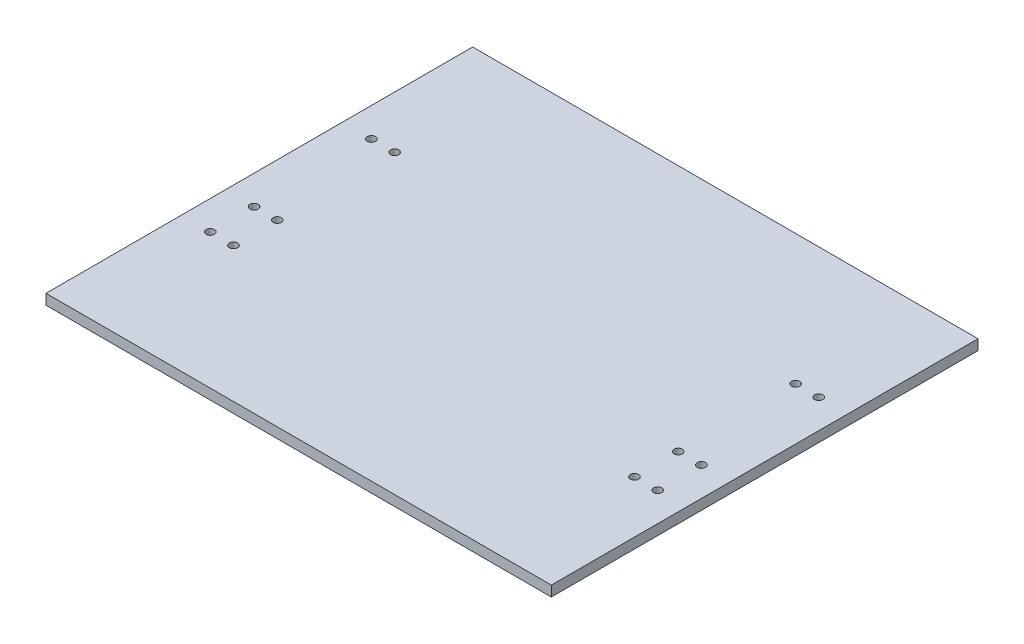
ISO-10303-21;
HEADER;
FILE_DESCRIPTION(('STEP AP214'),'2;1');
FILE_NAME('part.step','',(''),(''),'','','');
FILE_SCHEMA(('AUTOMOTIVE_DESIGN { 1 0 10303 214 1 1 1 1 }'));
ENDSEC;
DATA;
#1=APPLICATION_CONTEXT('core data for automotive mechanical design processes');
#2=APPLICATION_PROTOCOL_DEFINITION('international standard','automotive_design',2000,#1);
#3=PRODUCT_CONTEXT('',#1,'mechanical');
#4=PRODUCT('Part','Part','',(#3));
#5=PRODUCT_RELATED_PRODUCT_CATEGORY('part','',(#4));
#6=PRODUCT_DEFINITION_FORMATION('','',#4);
#7=PRODUCT_DEFINITION_CONTEXT('part definition',#1,'design');
#8=PRODUCT_DEFINITION('design','',#6,#7);
#9=PRODUCT_DEFINITION_SHAPE('','',#8);
#10=(LENGTH_UNIT() NAMED_UNIT(*) SI_UNIT(.MILLI.,.METRE.));
#11=(NAMED_UNIT(*) PLANE_ANGLE_UNIT() SI_UNIT($,.RADIAN.));
#12=(NAMED_UNIT(*) SI_UNIT($,.STERADIAN.) SOLID_ANGLE_UNIT());
#13=UNCERTAINTY_MEASURE_WITH_UNIT(LENGTH_MEASURE(1.E-05),#10,'distance_accuracy_value','');
#14=(GEOMETRIC_REPRESENTATION_CONTEXT(3) GLOBAL_UNCERTAINTY_ASSIGNED_CONTEXT((#13)) GLOBAL_UNIT_ASSIGNED_CONTEXT((#10,
#11,#12)) REPRESENTATION_CONTEXT('',''));
#15=CARTESIAN_POINT('',(0.,0.,0.));
#16=DIRECTION('',(0.,0.,1.));
#17=DIRECTION('',(1.,0.,0.));
#18=AXIS2_PLACEMENT_3D('',#15,#16,#17);
#19=CARTESIAN_POINT('',(-61.,0.,-51.5));
#20=DIRECTION('',(0.,0.,1.));
#21=DIRECTION('',(1.,0.,0.));
#22=AXIS2_PLACEMENT_3D('',#19,#20,#21);
#23=PLANE('',#22);
#24=DIRECTION('',(0.,-1.,0.));
#25=VECTOR('',#24,1.);
#26=CARTESIAN_POINT('',(-61.,1.25,-51.5));
#27=LINE('',#26,#25);
#28=CARTESIAN_POINT('',(-61.,2.5,-51.5));
#29=VERTEX_POINT('',#28);
#30=CARTESIAN_POINT('',(-61.,0.,-51.5));
#31=VERTEX_POINT('',#30);
#32=EDGE_CURVE('E62',#29,#31,#27,.T.);
#33=ORIENTED_EDGE('',*,*,#32,.F.);
#34=DIRECTION('',(1.,0.,0.));
#35=VECTOR('',#34,1.);
#36=CARTESIAN_POINT('',(0.,2.5,-51.5));
#37=LINE('',#36,#35);
#38=CARTESIAN_POINT('',(61.,2.5,-51.5));
#39=VERTEX_POINT('',#38);
#40=EDGE_CURVE('E65',#29,#39,#37,.T.);
#41=ORIENTED_EDGE('',*,*,#40,.T.);
#42=DIRECTION('',(0.,1.,0.));
#43=VECTOR('',#42,1.);
#44=CARTESIAN_POINT('',(61.,1.25,-51.5));
#45=LINE('',#44,#43);
#46=CARTESIAN_POINT('',(61.,0.,-51.5));
#47=VERTEX_POINT('',#46);
#48=EDGE_CURVE('E85',#47,#39,#45,.T.);
#49=ORIENTED_EDGE('',*,*,#48,.F.);
#50=DIRECTION('',(1.,0.,0.));
#51=VECTOR('',#50,1.);
#52=CARTESIAN_POINT('',(0.,0.,-51.5));
#53=LINE('',#52,#51);
#54=EDGE_CURVE('E66',#31,#47,#53,.T.);
#55=ORIENTED_EDGE('',*,*,#54,.F.);
#56=EDGE_LOOP('',(#33,#41,#49,#55));
#57=FACE_BOUND('',#56,.T.);
#58=ADVANCED_FACE('F17',(#57),#23,.F.);
#59=CARTESIAN_POINT('',(61.,0.,51.5));
#60=DIRECTION('',(1.,0.,0.));
#61=DIRECTION('',(0.,0.,-1.));
#62=AXIS2_PLACEMENT_3D('',#59,#60,#61);
#63=PLANE('',#62);
#64=ORIENTED_EDGE('',*,*,#48,.T.);
#65=DIRECTION('',(0.,0.,1.));
#66=VECTOR('',#65,1.);
#67=CARTESIAN_POINT('',(61.,2.5,0.));
#68=LINE('',#67,#66);
#69=CARTESIAN_POINT('',(61.,2.5,51.5));
#70=VERTEX_POINT('',#69);
#71=EDGE_CURVE('E76',#39,#70,#68,.T.);
#72=ORIENTED_EDGE('',*,*,#71,.T.);
#73=DIRECTION('',(0.,-1.,0.));
#74=VECTOR('',#73,1.);
#75=CARTESIAN_POINT('',(61.,1.25,51.5));
#76=LINE('',#75,#74);
#77=CARTESIAN_POINT('',(61.,0.,51.5));
#78=VERTEX_POINT('',#77);
#79=EDGE_CURVE('E67',#70,#78,#76,.T.);
#80=ORIENTED_EDGE('',*,*,#79,.T.);
#81=DIRECTION('',(0.,0.,1.));
#82=VECTOR('',#81,1.);
#83=CARTESIAN_POINT('',(61.,0.,0.));
#84=LINE('',#83,#82);
#85=EDGE_CURVE('E161',#47,#78,#84,.T.);
#86=ORIENTED_EDGE('',*,*,#85,.F.);
#87=EDGE_LOOP('',(#64,#72,#80,#86));
#88=FACE_BOUND('',#87,.T.);
#89=ADVANCED_FACE('F166',(#88),#63,.T.);
#90=CARTESIAN_POINT('',(61.,0.,51.5));
#91=DIRECTION('',(0.,0.,-1.));
#92=DIRECTION('',(-1.,0.,0.));
#93=AXIS2_PLACEMENT_3D('',#90,#91,#92);
#94=PLANE('',#93);
#95=ORIENTED_EDGE('',*,*,#79,.F.);
#96=DIRECTION('',(-1.,0.,0.));
#97=VECTOR('',#96,1.);
#98=CARTESIAN_POINT('',(0.,2.5,51.5));
#99=LINE('',#98,#97);
#100=CARTESIAN_POINT('',(-61.,2.5,51.5));
#101=VERTEX_POINT('',#100);
#102=EDGE_CURVE('E154',#70,#101,#99,.T.);
#103=ORIENTED_EDGE('',*,*,#102,.T.);
#104=DIRECTION('',(0.,1.,0.));
#105=VECTOR('',#104,1.);
#106=CARTESIAN_POINT('',(-61.,1.25,51.5));
#107=LINE('',#106,#105);
#108=CARTESIAN_POINT('',(-61.,0.,51.5));
#109=VERTEX_POINT('',#108);
#110=EDGE_CURVE('E56',#109,#101,#107,.T.);
#111=ORIENTED_EDGE('',*,*,#110,.F.);
#112=DIRECTION('',(-1.,0.,0.));
#113=VECTOR('',#112,1.);
#114=CARTESIAN_POINT('',(0.,0.,51.5));
#115=LINE('',#114,#113);
#116=EDGE_CURVE('E36',#78,#109,#115,.T.);
#117=ORIENTED_EDGE('',*,*,#116,.F.);
#118=EDGE_LOOP('',(#95,#103,#111,#117));
#119=FACE_BOUND('',#118,.T.);
#120=ADVANCED_FACE('F167',(#119),#94,.F.);
#121=CARTESIAN_POINT('',(-61.,0.,-51.5));
#122=DIRECTION('',(-1.,0.,0.));
#123=DIRECTION('',(0.,0.,1.));
#124=AXIS2_PLACEMENT_3D('',#121,#122,#123);
#125=PLANE('',#124);
#126=ORIENTED_EDGE('',*,*,#110,.T.);
#127=DIRECTION('',(0.,0.,-1.));
#128=VECTOR('',#127,1.);
#129=CARTESIAN_POINT('',(-61.,2.5,0.));
#130=LINE('',#129,#128);
#131=EDGE_CURVE('E73',#101,#29,#130,.T.);
#132=ORIENTED_EDGE('',*,*,#131,.T.);
#133=ORIENTED_EDGE('',*,*,#32,.T.);
#134=DIRECTION('',(0.,0.,-1.));
#135=VECTOR('',#134,1.);
#136=CARTESIAN_POINT('',(-61.,0.,0.));
#137=LINE('',#136,#135);
#138=EDGE_CURVE('E122',#109,#31,#137,.T.);
#139=ORIENTED_EDGE('',*,*,#138,.F.);
#140=EDGE_LOOP('',(#126,#132,#133,#139));
#141=FACE_BOUND('',#140,.T.);
#142=ADVANCED_FACE('F78',(#141),#125,.T.);
#143=CARTESIAN_POINT('',(48.4,2.5,8.27));
#144=DIRECTION('',(0.,-1.,0.));
#145=DIRECTION('',(1.,0.,0.));
#146=AXIS2_PLACEMENT_3D('',#143,#144,#145);
#147=CYLINDRICAL_SURFACE('',#146,0.999999999999999);
#148=CARTESIAN_POINT('',(48.4,0.,8.27));
#149=DIRECTION('',(0.,-1.,0.));
#150=DIRECTION('',(1.,0.,0.));
#151=AXIS2_PLACEMENT_3D('',#148,#149,#150);
#152=CIRCLE('',#151,0.999999999999999);
#153=CARTESIAN_POINT('',(49.4,0.,8.27));
#154=VERTEX_POINT('',#153);
#155=EDGE_CURVE('E119',#154,#154,#152,.F.);
#156=ORIENTED_EDGE('',*,*,#155,.F.);
#157=EDGE_LOOP('',(#156));
#158=FACE_BOUND('',#157,.T.);
#159=CARTESIAN_POINT('',(48.4,2.5,8.27));
#160=DIRECTION('',(0.,-1.,0.));
#161=DIRECTION('',(1.,0.,0.));
#162=AXIS2_PLACEMENT_3D('',#159,#160,#161);
#163=CIRCLE('',#162,0.999999999999999);
#164=CARTESIAN_POINT('',(49.4,2.5,8.27));
#165=VERTEX_POINT('',#164);
#166=EDGE_CURVE('E21',#165,#165,#163,.F.);
#167=ORIENTED_EDGE('',*,*,#166,.T.);
#168=EDGE_LOOP('',(#167));
#169=FACE_BOUND('',#168,.T.);
#170=ADVANCED_FACE('F175',(#158,#169),#147,.F.);
#171=CARTESIAN_POINT('',(48.4,2.5,-20.06));
#172=DIRECTION('',(0.,-1.,0.));
#173=DIRECTION('',(1.,0.,0.));
#174=AXIS2_PLACEMENT_3D('',#171,#172,#173);
#175=CYLINDRICAL_SURFACE('',#174,1.);
#176=CARTESIAN_POINT('',(48.4,0.,-20.06));
#177=DIRECTION('',(0.,-1.,0.));
#178=DIRECTION('',(1.,0.,0.));
#179=AXIS2_PLACEMENT_3D('',#176,#177,#178);
#180=CIRCLE('',#179,1.);
#181=CARTESIAN_POINT('',(49.4,0.,-20.06));
#182=VERTEX_POINT('',#181);
#183=EDGE_CURVE('E116',#182,#182,#180,.F.);
#184=ORIENTED_EDGE('',*,*,#183,.F.);
#185=EDGE_LOOP('',(#184));
#186=FACE_BOUND('',#185,.T.);
#187=CARTESIAN_POINT('',(48.4,2.5,-20.06));
#188=DIRECTION('',(0.,-1.,0.));
#189=DIRECTION('',(1.,0.,0.));
#190=AXIS2_PLACEMENT_3D('',#187,#188,#189);
#191=CIRCLE('',#190,1.);
#192=CARTESIAN_POINT('',(49.4,2.5,-20.06));
#193=VERTEX_POINT('',#192);
#194=EDGE_CURVE('E149',#193,#193,#191,.F.);
#195=ORIENTED_EDGE('',*,*,#194,.T.);
#196=EDGE_LOOP('',(#195));
#197=FACE_BOUND('',#196,.T.);
#198=ADVANCED_FACE('F223',(#186,#197),#175,.F.);
#199=CARTESIAN_POINT('',(-48.4,2.5,8.27));
#200=DIRECTION('',(0.,-1.,0.));
#201=DIRECTION('',(1.,0.,0.));
#202=AXIS2_PLACEMENT_3D('',#199,#200,#201);
#203=CYLINDRICAL_SURFACE('',#202,0.999999999999999);
#204=CARTESIAN_POINT('',(-48.4,0.,8.27));
#205=DIRECTION('',(0.,-1.,0.));
#206=DIRECTION('',(1.,0.,0.));
#207=AXIS2_PLACEMENT_3D('',#204,#205,#206);
#208=CIRCLE('',#207,0.999999999999999);
#209=CARTESIAN_POINT('',(-47.4,0.,8.27));
#210=VERTEX_POINT('',#209);
#211=EDGE_CURVE('E113',#210,#210,#208,.F.);
#212=ORIENTED_EDGE('',*,*,#211,.F.);
#213=EDGE_LOOP('',(#212));
#214=FACE_BOUND('',#213,.T.);
#215=CARTESIAN_POINT('',(-48.4,2.5,8.27));
#216=DIRECTION('',(0.,-1.,0.));
#217=DIRECTION('',(1.,0.,0.));
#218=AXIS2_PLACEMENT_3D('',#215,#216,#217);
#219=CIRCLE('',#218,0.999999999999999);
#220=CARTESIAN_POINT('',(-47.4,2.5,8.27));
#221=VERTEX_POINT('',#220);
#222=EDGE_CURVE('E147',#221,#221,#219,.F.);
#223=ORIENTED_EDGE('',*,*,#222,.T.);
#224=EDGE_LOOP('',(#223));
#225=FACE_BOUND('',#224,.T.);
#226=ADVANCED_FACE('F219',(#214,#225),#203,.F.);
#227=CARTESIAN_POINT('',(-48.4,2.5,-20.06));
#228=DIRECTION('',(0.,-1.,0.));
#229=DIRECTION('',(1.,0.,0.));
#230=AXIS2_PLACEMENT_3D('',#227,#228,#229);
#231=CYLINDRICAL_SURFACE('',#230,1.);
#232=CARTESIAN_POINT('',(-48.4,0.,-20.06));
#233=DIRECTION('',(0.,-1.,0.));
#234=DIRECTION('',(1.,0.,0.));
#235=AXIS2_PLACEMENT_3D('',#232,#233,#234);
#236=CIRCLE('',#235,1.);
#237=CARTESIAN_POINT('',(-47.4,0.,-20.06));
#238=VERTEX_POINT('',#237);
#239=EDGE_CURVE('E110',#238,#238,#236,.F.);
#240=ORIENTED_EDGE('',*,*,#239,.F.);
#241=EDGE_LOOP('',(#240));
#242=FACE_BOUND('',#241,.T.);
#243=CARTESIAN_POINT('',(-48.4,2.5,-20.06));
#244=DIRECTION('',(0.,-1.,0.));
#245=DIRECTION('',(1.,0.,0.));
#246=AXIS2_PLACEMENT_3D('',#243,#244,#245);
#247=CIRCLE('',#246,1.);
#248=CARTESIAN_POINT('',(-47.4,2.5,-20.06));
#249=VERTEX_POINT('',#248);
#250=EDGE_CURVE('E144',#249,#249,#247,.F.);
#251=ORIENTED_EDGE('',*,*,#250,.T.);
#252=EDGE_LOOP('',(#251));
#253=FACE_BOUND('',#252,.T.);
#254=ADVANCED_FACE('F215',(#242,#253),#231,.F.);
#255=CARTESIAN_POINT('',(-48.4,2.5,18.84));
#256=DIRECTION('',(0.,-1.,0.));
#257=DIRECTION('',(1.,0.,0.));
#258=AXIS2_PLACEMENT_3D('',#255,#256,#257);
#259=CYLINDRICAL_SURFACE('',#258,0.999999999999997);
#260=CARTESIAN_POINT('',(-48.4,0.,18.84));
#261=DIRECTION('',(0.,-1.,0.));
#262=DIRECTION('',(1.,0.,0.));
#263=AXIS2_PLACEMENT_3D('',#260,#261,#262);
#264=CIRCLE('',#263,0.999999999999997);
#265=CARTESIAN_POINT('',(-47.4,0.,18.84));
#266=VERTEX_POINT('',#265);
#267=EDGE_CURVE('E107',#266,#266,#264,.F.);
#268=ORIENTED_EDGE('',*,*,#267,.F.);
#269=EDGE_LOOP('',(#268));
#270=FACE_BOUND('',#269,.T.);
#271=CARTESIAN_POINT('',(-48.4,2.5,18.84));
#272=DIRECTION('',(0.,-1.,0.));
#273=DIRECTION('',(1.,0.,0.));
#274=AXIS2_PLACEMENT_3D('',#271,#272,#273);
#275=CIRCLE('',#274,0.999999999999997);
#276=CARTESIAN_POINT('',(-47.4,2.5,18.84));
#277=VERTEX_POINT('',#276);
#278=EDGE_CURVE('E141',#277,#277,#275,.F.);
#279=ORIENTED_EDGE('',*,*,#278,.T.);
#280=EDGE_LOOP('',(#279));
#281=FACE_BOUND('',#280,.T.);
#282=ADVANCED_FACE('F211',(#270,#281),#259,.F.);
#283=CARTESIAN_POINT('',(54.,2.5,18.84));
#284=DIRECTION('',(0.,-1.,0.));
#285=DIRECTION('',(1.,0.,0.));
#286=AXIS2_PLACEMENT_3D('',#283,#284,#285);
#287=CYLINDRICAL_SURFACE('',#286,0.999999999999997);
#288=CARTESIAN_POINT('',(54.,0.,18.84));
#289=DIRECTION('',(0.,-1.,0.));
#290=DIRECTION('',(1.,0.,0.));
#291=AXIS2_PLACEMENT_3D('',#288,#289,#290);
#292=CIRCLE('',#291,0.999999999999997);
#293=CARTESIAN_POINT('',(55.,0.,18.84));
#294=VERTEX_POINT('',#293);
#295=EDGE_CURVE('E104',#294,#294,#292,.F.);
#296=ORIENTED_EDGE('',*,*,#295,.F.);
#297=EDGE_LOOP('',(#296));
#298=FACE_BOUND('',#297,.T.);
#299=CARTESIAN_POINT('',(54.,2.5,18.84));
#300=DIRECTION('',(0.,-1.,0.));
#301=DIRECTION('',(1.,0.,0.));
#302=AXIS2_PLACEMENT_3D('',#299,#300,#301);
#303=CIRCLE('',#302,0.999999999999997);
#304=CARTESIAN_POINT('',(55.,2.5,18.84));
#305=VERTEX_POINT('',#304);
#306=EDGE_CURVE('E138',#305,#305,#303,.F.);
#307=ORIENTED_EDGE('',*,*,#306,.T.);
#308=EDGE_LOOP('',(#307));
#309=FACE_BOUND('',#308,.T.);
#310=ADVANCED_FACE('F207',(#298,#309),#287,.F.);
#311=CARTESIAN_POINT('',(54.,2.5,8.27));
#312=DIRECTION('',(0.,-1.,0.));
#313=DIRECTION('',(1.,0.,0.));
#314=AXIS2_PLACEMENT_3D('',#311,#312,#313);
#315=CYLINDRICAL_SURFACE('',#314,0.999999999999999);
#316=CARTESIAN_POINT('',(54.,0.,8.27));
#317=DIRECTION('',(0.,-1.,0.));
#318=DIRECTION('',(1.,0.,0.));
#319=AXIS2_PLACEMENT_3D('',#316,#317,#318);
#320=CIRCLE('',#319,0.999999999999999);
#321=CARTESIAN_POINT('',(55.,0.,8.27));
#322=VERTEX_POINT('',#321);
#323=EDGE_CURVE('E101',#322,#322,#320,.F.);
#324=ORIENTED_EDGE('',*,*,#323,.F.);
#325=EDGE_LOOP('',(#324));
#326=FACE_BOUND('',#325,.T.);
#327=CARTESIAN_POINT('',(54.,2.5,8.27));
#328=DIRECTION('',(0.,-1.,0.));
#329=DIRECTION('',(1.,0.,0.));
#330=AXIS2_PLACEMENT_3D('',#327,#328,#329);
#331=CIRCLE('',#330,0.999999999999999);
#332=CARTESIAN_POINT('',(55.,2.5,8.27));
#333=VERTEX_POINT('',#332);
#334=EDGE_CURVE('E135',#333,#333,#331,.F.);
#335=ORIENTED_EDGE('',*,*,#334,.T.);
#336=EDGE_LOOP('',(#335));
#337=FACE_BOUND('',#336,.T.);
#338=ADVANCED_FACE('F203',(#326,#337),#315,.F.);
#339=CARTESIAN_POINT('',(54.,2.5,-20.06));
#340=DIRECTION('',(0.,-1.,0.));
#341=DIRECTION('',(1.,0.,0.));
#342=AXIS2_PLACEMENT_3D('',#339,#340,#341);
#343=CYLINDRICAL_SURFACE('',#342,1.);
#344=CARTESIAN_POINT('',(54.,0.,-20.06));
#345=DIRECTION('',(0.,-1.,0.));
#346=DIRECTION('',(1.,0.,0.));
#347=AXIS2_PLACEMENT_3D('',#344,#345,#346);
#348=CIRCLE('',#347,1.);
#349=CARTESIAN_POINT('',(55.,0.,-20.06));
#350=VERTEX_POINT('',#349);
#351=EDGE_CURVE('E98',#350,#350,#348,.F.);
#352=ORIENTED_EDGE('',*,*,#351,.F.);
#353=EDGE_LOOP('',(#352));
#354=FACE_BOUND('',#353,.T.);
#355=CARTESIAN_POINT('',(54.,2.5,-20.06));
#356=DIRECTION('',(0.,-1.,0.));
#357=DIRECTION('',(1.,0.,0.));
#358=AXIS2_PLACEMENT_3D('',#355,#356,#357);
#359=CIRCLE('',#358,1.);
#360=CARTESIAN_POINT('',(55.,2.5,-20.06));
#361=VERTEX_POINT('',#360);
#362=EDGE_CURVE('E132',#361,#361,#359,.F.);
#363=ORIENTED_EDGE('',*,*,#362,.T.);
#364=EDGE_LOOP('',(#363));
#365=FACE_BOUND('',#364,.T.);
#366=ADVANCED_FACE('F199',(#354,#365),#343,.F.);
#367=CARTESIAN_POINT('',(-54.,2.5,18.84));
#368=DIRECTION('',(0.,-1.,0.));
#369=DIRECTION('',(1.,0.,0.));
#370=AXIS2_PLACEMENT_3D('',#367,#368,#369);
#371=CYLINDRICAL_SURFACE('',#370,0.999999999999997);
#372=CARTESIAN_POINT('',(-54.,0.,18.84));
#373=DIRECTION('',(0.,-1.,0.));
#374=DIRECTION('',(1.,0.,0.));
#375=AXIS2_PLACEMENT_3D('',#372,#373,#374);
#376=CIRCLE('',#375,0.999999999999997);
#377=CARTESIAN_POINT('',(-53.,0.,18.84));
#378=VERTEX_POINT('',#377);
#379=EDGE_CURVE('E95',#378,#378,#376,.F.);
#380=ORIENTED_EDGE('',*,*,#379,.F.);
#381=EDGE_LOOP('',(#380));
#382=FACE_BOUND('',#381,.T.);
#383=CARTESIAN_POINT('',(-54.,2.5,18.84));
#384=DIRECTION('',(0.,-1.,0.));
#385=DIRECTION('',(1.,0.,0.));
#386=AXIS2_PLACEMENT_3D('',#383,#384,#385);
#387=CIRCLE('',#386,0.999999999999997);
#388=CARTESIAN_POINT('',(-53.,2.5,18.84));
#389=VERTEX_POINT('',#388);
#390=EDGE_CURVE('E129',#389,#389,#387,.F.);
#391=ORIENTED_EDGE('',*,*,#390,.T.);
#392=EDGE_LOOP('',(#391));
#393=FACE_BOUND('',#392,.T.);
#394=ADVANCED_FACE('F195',(#382,#393),#371,.F.);
#395=CARTESIAN_POINT('',(-54.,2.5,8.27));
#396=DIRECTION('',(0.,-1.,0.));
#397=DIRECTION('',(1.,0.,0.));
#398=AXIS2_PLACEMENT_3D('',#395,#396,#397);
#399=CYLINDRICAL_SURFACE('',#398,0.999999999999999);
#400=CARTESIAN_POINT('',(-54.,0.,8.27));
#401=DIRECTION('',(0.,-1.,0.));
#402=DIRECTION('',(1.,0.,0.));
#403=AXIS2_PLACEMENT_3D('',#400,#401,#402);
#404=CIRCLE('',#403,0.999999999999999);
#405=CARTESIAN_POINT('',(-53.,0.,8.27));
#406=VERTEX_POINT('',#405);
#407=EDGE_CURVE('E92',#406,#406,#404,.F.);
#408=ORIENTED_EDGE('',*,*,#407,.F.);
#409=EDGE_LOOP('',(#408));
#410=FACE_BOUND('',#409,.T.);
#411=CARTESIAN_POINT('',(-54.,2.5,8.27));
#412=DIRECTION('',(0.,-1.,0.));
#413=DIRECTION('',(1.,0.,0.));
#414=AXIS2_PLACEMENT_3D('',#411,#412,#413);
#415=CIRCLE('',#414,0.999999999999999);
#416=CARTESIAN_POINT('',(-53.,2.5,8.27));
#417=VERTEX_POINT('',#416);
#418=EDGE_CURVE('E126',#417,#417,#415,.F.);
#419=ORIENTED_EDGE('',*,*,#418,.T.);
#420=EDGE_LOOP('',(#419));
#421=FACE_BOUND('',#420,.T.);
#422=ADVANCED_FACE('F191',(#410,#421),#399,.F.);
#423=CARTESIAN_POINT('',(-54.,2.5,-20.06));
#424=DIRECTION('',(0.,-1.,0.));
#425=DIRECTION('',(1.,0.,0.));
#426=AXIS2_PLACEMENT_3D('',#423,#424,#425);
#427=CYLINDRICAL_SURFACE('',#426,1.);
#428=CARTESIAN_POINT('',(-54.,0.,-20.06));
#429=DIRECTION('',(0.,-1.,0.));
#430=DIRECTION('',(1.,0.,0.));
#431=AXIS2_PLACEMENT_3D('',#428,#429,#430);
#432=CIRCLE('',#431,1.);
#433=CARTESIAN_POINT('',(-53.,0.,-20.06));
#434=VERTEX_POINT('',#433);
#435=EDGE_CURVE('E89',#434,#434,#432,.F.);
#436=ORIENTED_EDGE('',*,*,#435,.F.);
#437=EDGE_LOOP('',(#436));
#438=FACE_BOUND('',#437,.T.);
#439=CARTESIAN_POINT('',(-54.,2.5,-20.06));
#440=DIRECTION('',(0.,-1.,0.));
#441=DIRECTION('',(1.,0.,0.));
#442=AXIS2_PLACEMENT_3D('',#439,#440,#441);
#443=CIRCLE('',#442,1.);
#444=CARTESIAN_POINT('',(-53.,2.5,-20.06));
#445=VERTEX_POINT('',#444);
#446=EDGE_CURVE('E123',#445,#445,#443,.F.);
#447=ORIENTED_EDGE('',*,*,#446,.T.);
#448=EDGE_LOOP('',(#447));
#449=FACE_BOUND('',#448,.T.);
#450=ADVANCED_FACE('F188',(#438,#449),#427,.F.);
#451=CARTESIAN_POINT('',(-61.,2.5,51.5));
#452=DIRECTION('',(0.,-1.,0.));
#453=DIRECTION('',(0.,0.,-1.));
#454=AXIS2_PLACEMENT_3D('',#451,#452,#453);
#455=PLANE('',#454);
#456=ORIENTED_EDGE('',*,*,#446,.F.);
#457=EDGE_LOOP('',(#456));
#458=FACE_BOUND('',#457,.T.);
#459=ORIENTED_EDGE('',*,*,#418,.F.);
#460=EDGE_LOOP('',(#459));
#461=FACE_BOUND('',#460,.T.);
#462=ORIENTED_EDGE('',*,*,#390,.F.);
#463=EDGE_LOOP('',(#462));
#464=FACE_BOUND('',#463,.T.);
#465=ORIENTED_EDGE('',*,*,#362,.F.);
#466=EDGE_LOOP('',(#465));
#467=FACE_BOUND('',#466,.T.);
#468=ORIENTED_EDGE('',*,*,#334,.F.);
#469=EDGE_LOOP('',(#468));
#470=FACE_BOUND('',#469,.T.);
#471=ORIENTED_EDGE('',*,*,#306,.F.);
#472=EDGE_LOOP('',(#471));
#473=FACE_BOUND('',#472,.T.);
#474=ORIENTED_EDGE('',*,*,#278,.F.);
#475=EDGE_LOOP('',(#474));
#476=FACE_BOUND('',#475,.T.);
#477=ORIENTED_EDGE('',*,*,#250,.F.);
#478=EDGE_LOOP('',(#477));
#479=FACE_BOUND('',#478,.T.);
#480=ORIENTED_EDGE('',*,*,#222,.F.);
#481=EDGE_LOOP('',(#480));
#482=FACE_BOUND('',#481,.T.);
#483=ORIENTED_EDGE('',*,*,#194,.F.);
#484=EDGE_LOOP('',(#483));
#485=FACE_BOUND('',#484,.T.);
#486=ORIENTED_EDGE('',*,*,#166,.F.);
#487=EDGE_LOOP('',(#486));
#488=FACE_BOUND('',#487,.T.);
#489=CARTESIAN_POINT('',(48.4,2.5,18.84));
#490=DIRECTION('',(0.,-1.,0.));
#491=DIRECTION('',(1.,0.,0.));
#492=AXIS2_PLACEMENT_3D('',#489,#490,#491);
#493=CIRCLE('',#492,0.999999999999997);
#494=CARTESIAN_POINT('',(49.4,2.5,18.84));
#495=VERTEX_POINT('',#494);
#496=EDGE_CURVE('E27',#495,#495,#493,.F.);
#497=ORIENTED_EDGE('',*,*,#496,.F.);
#498=EDGE_LOOP('',(#497));
#499=FACE_BOUND('',#498,.T.);
#500=ORIENTED_EDGE('',*,*,#71,.F.);
#501=ORIENTED_EDGE('',*,*,#40,.F.);
#502=ORIENTED_EDGE('',*,*,#131,.F.);
#503=ORIENTED_EDGE('',*,*,#102,.F.);
#504=EDGE_LOOP('',(#500,#501,#502,#503));
#505=FACE_BOUND('',#504,.T.);
#506=ADVANCED_FACE('F71',(#458,#461,#464,#467,#470,#473,#476,#479,#482,#485,#488,#499,#505),
#455,.F.);
#507=CARTESIAN_POINT('',(-61.,0.,51.5));
#508=DIRECTION('',(0.,-1.,0.));
#509=DIRECTION('',(0.,0.,-1.));
#510=AXIS2_PLACEMENT_3D('',#507,#508,#509);
#511=PLANE('',#510);
#512=ORIENTED_EDGE('',*,*,#435,.T.);
#513=EDGE_LOOP('',(#512));
#514=FACE_BOUND('',#513,.T.);
#515=ORIENTED_EDGE('',*,*,#407,.T.);
#516=EDGE_LOOP('',(#515));
#517=FACE_BOUND('',#516,.T.);
#518=ORIENTED_EDGE('',*,*,#379,.T.);
#519=EDGE_LOOP('',(#518));
#520=FACE_BOUND('',#519,.T.);
#521=ORIENTED_EDGE('',*,*,#351,.T.);
#522=EDGE_LOOP('',(#521));
#523=FACE_BOUND('',#522,.T.);
#524=ORIENTED_EDGE('',*,*,#323,.T.);
#525=EDGE_LOOP('',(#524));
#526=FACE_BOUND('',#525,.T.);
#527=ORIENTED_EDGE('',*,*,#295,.T.);
#528=EDGE_LOOP('',(#527));
#529=FACE_BOUND('',#528,.T.);
#530=ORIENTED_EDGE('',*,*,#267,.T.);
#531=EDGE_LOOP('',(#530));
#532=FACE_BOUND('',#531,.T.);
#533=ORIENTED_EDGE('',*,*,#239,.T.);
#534=EDGE_LOOP('',(#533));
#535=FACE_BOUND('',#534,.T.);
#536=ORIENTED_EDGE('',*,*,#211,.T.);
#537=EDGE_LOOP('',(#536));
#538=FACE_BOUND('',#537,.T.);
#539=ORIENTED_EDGE('',*,*,#183,.T.);
#540=EDGE_LOOP('',(#539));
#541=FACE_BOUND('',#540,.T.);
#542=ORIENTED_EDGE('',*,*,#155,.T.);
#543=EDGE_LOOP('',(#542));
#544=FACE_BOUND('',#543,.T.);
#545=CARTESIAN_POINT('',(48.4,0.,18.84));
#546=DIRECTION('',(0.,-1.,0.));
#547=DIRECTION('',(1.,0.,0.));
#548=AXIS2_PLACEMENT_3D('',#545,#546,#547);
#549=CIRCLE('',#548,0.999999999999997);
#550=CARTESIAN_POINT('',(49.4,0.,18.84));
#551=VERTEX_POINT('',#550);
#552=EDGE_CURVE('E11',#551,#551,#549,.T.);
#553=ORIENTED_EDGE('',*,*,#552,.F.);
#554=EDGE_LOOP('',(#553));
#555=FACE_BOUND('',#554,.T.);
#556=ORIENTED_EDGE('',*,*,#116,.T.);
#557=ORIENTED_EDGE('',*,*,#138,.T.);
#558=ORIENTED_EDGE('',*,*,#54,.T.);
#559=ORIENTED_EDGE('',*,*,#85,.T.);
#560=EDGE_LOOP('',(#556,#557,#558,#559));
#561=FACE_BOUND('',#560,.T.);
#562=ADVANCED_FACE('F19',(#514,#517,#520,#523,#526,#529,#532,#535,#538,#541,#544,#555,#561),
#511,.T.);
#563=CARTESIAN_POINT('',(48.4,2.5,18.84));
#564=DIRECTION('',(0.,-1.,0.));
#565=DIRECTION('',(1.,0.,0.));
#566=AXIS2_PLACEMENT_3D('',#563,#564,#565);
#567=CYLINDRICAL_SURFACE('',#566,0.999999999999997);
#568=ORIENTED_EDGE('',*,*,#552,.T.);
#569=EDGE_LOOP('',(#568));
#570=FACE_BOUND('',#569,.T.);
#571=ORIENTED_EDGE('',*,*,#496,.T.);
#572=EDGE_LOOP('',(#571));
#573=FACE_BOUND('',#572,.T.);
#574=ADVANCED_FACE('F178',(#570,#573),#567,.F.);
#575=CLOSED_SHELL('',(#58,#89,#120,#142,#170,#198,#226,#254,#282,#310,#338,#366,#394,#422,#450,
#506,#562,#574));
#576=MANIFOLD_SOLID_BREP('B1',#575);
#577=ADVANCED_BREP_SHAPE_REPRESENTATION('',(#18,#576),#14);
#578=SHAPE_DEFINITION_REPRESENTATION(#9,#577);
ENDSEC;
END-ISO-10303-21;
